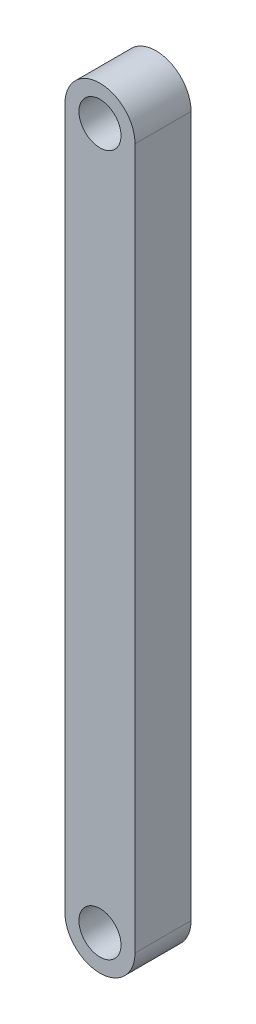
ISO-10303-21;
HEADER;
FILE_DESCRIPTION(('STEP AP214'),'2;1');
FILE_NAME('part.step','',(''),(''),'','','');
FILE_SCHEMA(('AUTOMOTIVE_DESIGN { 1 0 10303 214 1 1 1 1 }'));
ENDSEC;
DATA;
#1=APPLICATION_CONTEXT('core data for automotive mechanical design processes');
#2=APPLICATION_PROTOCOL_DEFINITION('international standard','automotive_design',2000,#1);
#3=PRODUCT_CONTEXT('',#1,'mechanical');
#4=PRODUCT('Part','Part','',(#3));
#5=PRODUCT_RELATED_PRODUCT_CATEGORY('part','',(#4));
#6=PRODUCT_DEFINITION_FORMATION('','',#4);
#7=PRODUCT_DEFINITION_CONTEXT('part definition',#1,'design');
#8=PRODUCT_DEFINITION('design','',#6,#7);
#9=PRODUCT_DEFINITION_SHAPE('','',#8);
#10=(LENGTH_UNIT() NAMED_UNIT(*) SI_UNIT(.MILLI.,.METRE.));
#11=(NAMED_UNIT(*) PLANE_ANGLE_UNIT() SI_UNIT($,.RADIAN.));
#12=(NAMED_UNIT(*) SI_UNIT($,.STERADIAN.) SOLID_ANGLE_UNIT());
#13=UNCERTAINTY_MEASURE_WITH_UNIT(LENGTH_MEASURE(1.E-05),#10,'distance_accuracy_value','');
#14=(GEOMETRIC_REPRESENTATION_CONTEXT(3) GLOBAL_UNCERTAINTY_ASSIGNED_CONTEXT((#13)) GLOBAL_UNIT_ASSIGNED_CONTEXT((#10,
#11,#12)) REPRESENTATION_CONTEXT('',''));
#15=CARTESIAN_POINT('',(0.,0.,0.));
#16=DIRECTION('',(0.,0.,1.));
#17=DIRECTION('',(1.,0.,0.));
#18=AXIS2_PLACEMENT_3D('',#15,#16,#17);
#19=CARTESIAN_POINT('',(-6.30999263260674E-13,-125.,20.));
#20=DIRECTION('',(0.,0.,1.));
#21=DIRECTION('',(1.,0.,0.));
#22=AXIS2_PLACEMENT_3D('',#19,#20,#21);
#23=PLANE('',#22);
#24=CARTESIAN_POINT('',(0.,125.,20.));
#25=DIRECTION('',(0.,0.,1.));
#26=DIRECTION('',(1.,0.,0.));
#27=AXIS2_PLACEMENT_3D('',#24,#25,#26);
#28=CIRCLE('',#27,7.5);
#29=CARTESIAN_POINT('',(7.49999999999996,125.,20.));
#30=VERTEX_POINT('',#29);
#31=EDGE_CURVE('E99',#30,#30,#28,.T.);
#32=ORIENTED_EDGE('',*,*,#31,.F.);
#33=EDGE_LOOP('',(#32));
#34=FACE_BOUND('',#33,.T.);
#35=CARTESIAN_POINT('',(-6.30999263260674E-13,-125.,20.));
#36=DIRECTION('',(0.,0.,1.));
#37=DIRECTION('',(1.,0.,0.));
#38=AXIS2_PLACEMENT_3D('',#35,#36,#37);
#39=CIRCLE('',#38,12.5);
#40=CARTESIAN_POINT('',(-12.5,-125.,20.));
#41=VERTEX_POINT('',#40);
#42=CARTESIAN_POINT('',(12.5,-125.,20.));
#43=VERTEX_POINT('',#42);
#44=EDGE_CURVE('E84',#41,#43,#39,.T.);
#45=ORIENTED_EDGE('',*,*,#44,.T.);
#46=DIRECTION('',(0.,1.,0.));
#47=VECTOR('',#46,1.);
#48=CARTESIAN_POINT('',(12.5,-125.,20.));
#49=LINE('',#48,#47);
#50=CARTESIAN_POINT('',(12.5000000000003,125.,20.));
#51=VERTEX_POINT('',#50);
#52=EDGE_CURVE('E79',#43,#51,#49,.T.);
#53=ORIENTED_EDGE('',*,*,#52,.T.);
#54=CARTESIAN_POINT('',(0.,125.,20.));
#55=DIRECTION('',(0.,0.,1.));
#56=DIRECTION('',(1.,0.,0.));
#57=AXIS2_PLACEMENT_3D('',#54,#55,#56);
#58=CIRCLE('',#57,12.5000000000004);
#59=CARTESIAN_POINT('',(-12.5,125.,20.));
#60=VERTEX_POINT('',#59);
#61=EDGE_CURVE('E82',#51,#60,#58,.T.);
#62=ORIENTED_EDGE('',*,*,#61,.T.);
#63=DIRECTION('',(0.,-1.,0.));
#64=VECTOR('',#63,1.);
#65=CARTESIAN_POINT('',(-12.5,-125.,20.));
#66=LINE('',#65,#64);
#67=EDGE_CURVE('E49',#60,#41,#66,.T.);
#68=ORIENTED_EDGE('',*,*,#67,.T.);
#69=EDGE_LOOP('',(#45,#53,#62,#68));
#70=FACE_BOUND('',#69,.T.);
#71=CARTESIAN_POINT('',(-6.30999263260674E-13,-125.,20.));
#72=DIRECTION('',(0.,0.,1.));
#73=DIRECTION('',(1.,0.,0.));
#74=AXIS2_PLACEMENT_3D('',#71,#72,#73);
#75=CIRCLE('',#74,7.5);
#76=CARTESIAN_POINT('',(7.49999999999937,-125.,20.));
#77=VERTEX_POINT('',#76);
#78=EDGE_CURVE('E114',#77,#77,#75,.T.);
#79=ORIENTED_EDGE('',*,*,#78,.F.);
#80=EDGE_LOOP('',(#79));
#81=FACE_BOUND('',#80,.T.);
#82=ADVANCED_FACE('F32',(#34,#70,#81),#23,.T.);
#83=CARTESIAN_POINT('',(-6.30999263260674E-13,-125.,0.));
#84=DIRECTION('',(0.,0.,1.));
#85=DIRECTION('',(1.,0.,0.));
#86=AXIS2_PLACEMENT_3D('',#83,#84,#85);
#87=PLANE('',#86);
#88=CARTESIAN_POINT('',(0.,125.,0.));
#89=DIRECTION('',(0.,0.,1.));
#90=DIRECTION('',(1.,0.,0.));
#91=AXIS2_PLACEMENT_3D('',#88,#89,#90);
#92=CIRCLE('',#91,7.5);
#93=CARTESIAN_POINT('',(7.49999999999996,125.,0.));
#94=VERTEX_POINT('',#93);
#95=EDGE_CURVE('E111',#94,#94,#92,.T.);
#96=ORIENTED_EDGE('',*,*,#95,.T.);
#97=EDGE_LOOP('',(#96));
#98=FACE_BOUND('',#97,.T.);
#99=CARTESIAN_POINT('',(-6.30999263260674E-13,-125.,0.));
#100=DIRECTION('',(0.,0.,1.));
#101=DIRECTION('',(1.,0.,0.));
#102=AXIS2_PLACEMENT_3D('',#99,#100,#101);
#103=CIRCLE('',#102,12.5);
#104=CARTESIAN_POINT('',(-12.5,-125.,0.));
#105=VERTEX_POINT('',#104);
#106=CARTESIAN_POINT('',(12.5,-125.,0.));
#107=VERTEX_POINT('',#106);
#108=EDGE_CURVE('E96',#105,#107,#103,.T.);
#109=ORIENTED_EDGE('',*,*,#108,.F.);
#110=DIRECTION('',(0.,-1.,0.));
#111=VECTOR('',#110,1.);
#112=CARTESIAN_POINT('',(-12.5,-125.,0.));
#113=LINE('',#112,#111);
#114=CARTESIAN_POINT('',(-12.5,125.,0.));
#115=VERTEX_POINT('',#114);
#116=EDGE_CURVE('E72',#115,#105,#113,.T.);
#117=ORIENTED_EDGE('',*,*,#116,.F.);
#118=CARTESIAN_POINT('',(0.,125.,0.));
#119=DIRECTION('',(0.,0.,1.));
#120=DIRECTION('',(1.,0.,0.));
#121=AXIS2_PLACEMENT_3D('',#118,#119,#120);
#122=CIRCLE('',#121,12.5000000000004);
#123=CARTESIAN_POINT('',(12.5000000000003,125.,0.));
#124=VERTEX_POINT('',#123);
#125=EDGE_CURVE('E66',#124,#115,#122,.T.);
#126=ORIENTED_EDGE('',*,*,#125,.F.);
#127=DIRECTION('',(0.,1.,0.));
#128=VECTOR('',#127,1.);
#129=CARTESIAN_POINT('',(12.5,-125.,0.));
#130=LINE('',#129,#128);
#131=EDGE_CURVE('E88',#107,#124,#130,.T.);
#132=ORIENTED_EDGE('',*,*,#131,.F.);
#133=EDGE_LOOP('',(#109,#117,#126,#132));
#134=FACE_BOUND('',#133,.T.);
#135=CARTESIAN_POINT('',(-6.30999263260674E-13,-125.,0.));
#136=DIRECTION('',(0.,0.,1.));
#137=DIRECTION('',(1.,0.,0.));
#138=AXIS2_PLACEMENT_3D('',#135,#136,#137);
#139=CIRCLE('',#138,7.5);
#140=CARTESIAN_POINT('',(7.49999999999937,-125.,0.));
#141=VERTEX_POINT('',#140);
#142=EDGE_CURVE('E117',#141,#141,#139,.T.);
#143=ORIENTED_EDGE('',*,*,#142,.T.);
#144=EDGE_LOOP('',(#143));
#145=FACE_BOUND('',#144,.T.);
#146=ADVANCED_FACE('F107',(#98,#134,#145),#87,.F.);
#147=CARTESIAN_POINT('',(-6.30999263260674E-13,-125.,20.));
#148=DIRECTION('',(0.,0.,-1.));
#149=DIRECTION('',(-1.,0.,0.));
#150=AXIS2_PLACEMENT_3D('',#147,#148,#149);
#151=CYLINDRICAL_SURFACE('',#150,12.5);
#152=ORIENTED_EDGE('',*,*,#108,.T.);
#153=DIRECTION('',(0.,0.,-1.));
#154=VECTOR('',#153,1.);
#155=CARTESIAN_POINT('',(12.5,-125.,20.));
#156=LINE('',#155,#154);
#157=EDGE_CURVE('E11',#43,#107,#156,.T.);
#158=ORIENTED_EDGE('',*,*,#157,.F.);
#159=ORIENTED_EDGE('',*,*,#44,.F.);
#160=DIRECTION('',(0.,0.,-1.));
#161=VECTOR('',#160,1.);
#162=CARTESIAN_POINT('',(-12.5,-125.,20.));
#163=LINE('',#162,#161);
#164=EDGE_CURVE('E92',#41,#105,#163,.T.);
#165=ORIENTED_EDGE('',*,*,#164,.T.);
#166=EDGE_LOOP('',(#152,#158,#159,#165));
#167=FACE_BOUND('',#166,.T.);
#168=ADVANCED_FACE('F34',(#167),#151,.T.);
#169=CARTESIAN_POINT('',(12.5,-125.,20.));
#170=DIRECTION('',(-1.,0.,0.));
#171=DIRECTION('',(0.,-1.,0.));
#172=AXIS2_PLACEMENT_3D('',#169,#170,#171);
#173=PLANE('',#172);
#174=ORIENTED_EDGE('',*,*,#131,.T.);
#175=DIRECTION('',(0.,0.,-1.));
#176=VECTOR('',#175,1.);
#177=CARTESIAN_POINT('',(12.5000000000003,125.,20.));
#178=LINE('',#177,#176);
#179=EDGE_CURVE('E41',#51,#124,#178,.T.);
#180=ORIENTED_EDGE('',*,*,#179,.F.);
#181=ORIENTED_EDGE('',*,*,#52,.F.);
#182=ORIENTED_EDGE('',*,*,#157,.T.);
#183=EDGE_LOOP('',(#174,#180,#181,#182));
#184=FACE_BOUND('',#183,.T.);
#185=ADVANCED_FACE('F87',(#184),#173,.F.);
#186=CARTESIAN_POINT('',(0.,125.,20.));
#187=DIRECTION('',(0.,0.,-1.));
#188=DIRECTION('',(-1.,0.,0.));
#189=AXIS2_PLACEMENT_3D('',#186,#187,#188);
#190=CYLINDRICAL_SURFACE('',#189,12.5000000000004);
#191=ORIENTED_EDGE('',*,*,#125,.T.);
#192=DIRECTION('',(0.,0.,-1.));
#193=VECTOR('',#192,1.);
#194=CARTESIAN_POINT('',(-12.5,125.,20.));
#195=LINE('',#194,#193);
#196=EDGE_CURVE('E89',#60,#115,#195,.T.);
#197=ORIENTED_EDGE('',*,*,#196,.F.);
#198=ORIENTED_EDGE('',*,*,#61,.F.);
#199=ORIENTED_EDGE('',*,*,#179,.T.);
#200=EDGE_LOOP('',(#191,#197,#198,#199));
#201=FACE_BOUND('',#200,.T.);
#202=ADVANCED_FACE('F90',(#201),#190,.T.);
#203=CARTESIAN_POINT('',(-12.5,-125.,20.));
#204=DIRECTION('',(1.,0.,0.));
#205=DIRECTION('',(0.,1.,0.));
#206=AXIS2_PLACEMENT_3D('',#203,#204,#205);
#207=PLANE('',#206);
#208=ORIENTED_EDGE('',*,*,#116,.T.);
#209=ORIENTED_EDGE('',*,*,#164,.F.);
#210=ORIENTED_EDGE('',*,*,#67,.F.);
#211=ORIENTED_EDGE('',*,*,#196,.T.);
#212=EDGE_LOOP('',(#208,#209,#210,#211));
#213=FACE_BOUND('',#212,.T.);
#214=ADVANCED_FACE('F104',(#213),#207,.F.);
#215=CARTESIAN_POINT('',(0.,125.,20.));
#216=DIRECTION('',(0.,0.,-1.));
#217=DIRECTION('',(-1.,0.,0.));
#218=AXIS2_PLACEMENT_3D('',#215,#216,#217);
#219=CYLINDRICAL_SURFACE('',#218,7.5);
#220=ORIENTED_EDGE('',*,*,#31,.T.);
#221=EDGE_LOOP('',(#220));
#222=FACE_BOUND('',#221,.T.);
#223=ORIENTED_EDGE('',*,*,#95,.F.);
#224=EDGE_LOOP('',(#223));
#225=FACE_BOUND('',#224,.T.);
#226=ADVANCED_FACE('F135',(#222,#225),#219,.F.);
#227=CARTESIAN_POINT('',(-6.30999263260674E-13,-125.,20.));
#228=DIRECTION('',(0.,0.,-1.));
#229=DIRECTION('',(-1.,0.,0.));
#230=AXIS2_PLACEMENT_3D('',#227,#228,#229);
#231=CYLINDRICAL_SURFACE('',#230,7.5);
#232=ORIENTED_EDGE('',*,*,#78,.T.);
#233=EDGE_LOOP('',(#232));
#234=FACE_BOUND('',#233,.T.);
#235=ORIENTED_EDGE('',*,*,#142,.F.);
#236=EDGE_LOOP('',(#235));
#237=FACE_BOUND('',#236,.T.);
#238=ADVANCED_FACE('F123',(#234,#237),#231,.F.);
#239=CLOSED_SHELL('',(#82,#146,#168,#185,#202,#214,#226,#238));
#240=MANIFOLD_SOLID_BREP('B2',#239);
#241=ADVANCED_BREP_SHAPE_REPRESENTATION('',(#18,#240),#14);
#242=SHAPE_DEFINITION_REPRESENTATION(#9,#241);
ENDSEC;
END-ISO-10303-21;
